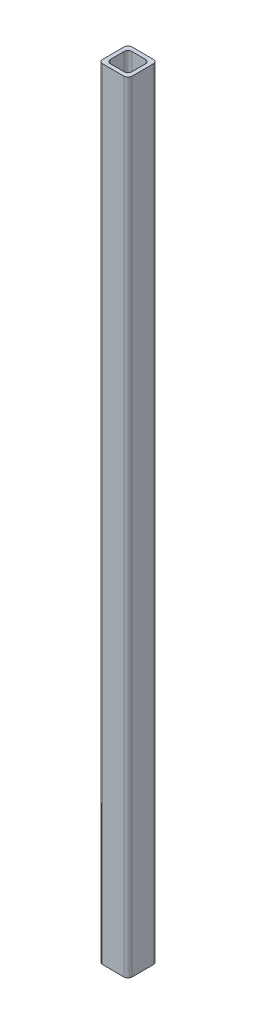
ISO-10303-21;
HEADER;
FILE_DESCRIPTION(('STEP AP214'),'2;1');
FILE_NAME('part.step','',(''),(''),'','','');
FILE_SCHEMA(('AUTOMOTIVE_DESIGN { 1 0 10303 214 1 1 1 1 }'));
ENDSEC;
DATA;
#1=APPLICATION_CONTEXT('core data for automotive mechanical design processes');
#2=APPLICATION_PROTOCOL_DEFINITION('international standard','automotive_design',2000,#1);
#3=PRODUCT_CONTEXT('',#1,'mechanical');
#4=PRODUCT('Part','Part','',(#3));
#5=PRODUCT_RELATED_PRODUCT_CATEGORY('part','',(#4));
#6=PRODUCT_DEFINITION_FORMATION('','',#4);
#7=PRODUCT_DEFINITION_CONTEXT('part definition',#1,'design');
#8=PRODUCT_DEFINITION('design','',#6,#7);
#9=PRODUCT_DEFINITION_SHAPE('','',#8);
#10=(LENGTH_UNIT() NAMED_UNIT(*) SI_UNIT(.MILLI.,.METRE.));
#11=(NAMED_UNIT(*) PLANE_ANGLE_UNIT() SI_UNIT($,.RADIAN.));
#12=(NAMED_UNIT(*) SI_UNIT($,.STERADIAN.) SOLID_ANGLE_UNIT());
#13=UNCERTAINTY_MEASURE_WITH_UNIT(LENGTH_MEASURE(1.E-05),#10,'distance_accuracy_value','');
#14=(GEOMETRIC_REPRESENTATION_CONTEXT(3) GLOBAL_UNCERTAINTY_ASSIGNED_CONTEXT((#13)) GLOBAL_UNIT_ASSIGNED_CONTEXT((#10,
#11,#12)) REPRESENTATION_CONTEXT('',''));
#15=CARTESIAN_POINT('',(0.,0.,0.));
#16=DIRECTION('',(0.,0.,1.));
#17=DIRECTION('',(1.,0.,0.));
#18=AXIS2_PLACEMENT_3D('',#15,#16,#17);
#19=CARTESIAN_POINT('',(11.,800.,-11.));
#20=DIRECTION('',(0.,-1.,0.));
#21=DIRECTION('',(0.,0.,-1.));
#22=AXIS2_PLACEMENT_3D('',#19,#20,#21);
#23=PLANE('',#22);
#24=CARTESIAN_POINT('',(11.,800.,-11.));
#25=DIRECTION('',(0.,1.,0.));
#26=DIRECTION('',(0.,0.,-1.));
#27=AXIS2_PLACEMENT_3D('',#24,#25,#26);
#28=CIRCLE('',#27,4.);
#29=CARTESIAN_POINT('',(15.,800.,-11.));
#30=VERTEX_POINT('',#29);
#31=CARTESIAN_POINT('',(11.,800.,-15.));
#32=VERTEX_POINT('',#31);
#33=EDGE_CURVE('E244',#30,#32,#28,.T.);
#34=ORIENTED_EDGE('',*,*,#33,.T.);
#35=DIRECTION('',(-1.,0.,0.));
#36=VECTOR('',#35,1.);
#37=CARTESIAN_POINT('',(11.,800.,-15.));
#38=LINE('',#37,#36);
#39=CARTESIAN_POINT('',(-11.,800.,-15.));
#40=VERTEX_POINT('',#39);
#41=EDGE_CURVE('E248',#32,#40,#38,.T.);
#42=ORIENTED_EDGE('',*,*,#41,.T.);
#43=CARTESIAN_POINT('',(-11.,800.,-11.));
#44=DIRECTION('',(0.,1.,0.));
#45=DIRECTION('',(0.,0.,-1.));
#46=AXIS2_PLACEMENT_3D('',#43,#44,#45);
#47=CIRCLE('',#46,4.);
#48=CARTESIAN_POINT('',(-15.,800.,-11.));
#49=VERTEX_POINT('',#48);
#50=EDGE_CURVE('E252',#40,#49,#47,.T.);
#51=ORIENTED_EDGE('',*,*,#50,.T.);
#52=DIRECTION('',(0.,0.,1.));
#53=VECTOR('',#52,1.);
#54=CARTESIAN_POINT('',(-15.,800.,-11.));
#55=LINE('',#54,#53);
#56=CARTESIAN_POINT('',(-15.,800.,11.));
#57=VERTEX_POINT('',#56);
#58=EDGE_CURVE('E255',#49,#57,#55,.T.);
#59=ORIENTED_EDGE('',*,*,#58,.T.);
#60=CARTESIAN_POINT('',(-11.,800.,11.));
#61=DIRECTION('',(0.,1.,0.));
#62=DIRECTION('',(0.,0.,1.));
#63=AXIS2_PLACEMENT_3D('',#60,#61,#62);
#64=CIRCLE('',#63,4.);
#65=CARTESIAN_POINT('',(-11.,800.,15.));
#66=VERTEX_POINT('',#65);
#67=EDGE_CURVE('E258',#57,#66,#64,.T.);
#68=ORIENTED_EDGE('',*,*,#67,.T.);
#69=DIRECTION('',(1.,0.,0.));
#70=VECTOR('',#69,1.);
#71=CARTESIAN_POINT('',(11.,800.,15.));
#72=LINE('',#71,#70);
#73=CARTESIAN_POINT('',(11.,800.,15.));
#74=VERTEX_POINT('',#73);
#75=EDGE_CURVE('E261',#66,#74,#72,.T.);
#76=ORIENTED_EDGE('',*,*,#75,.T.);
#77=CARTESIAN_POINT('',(11.,800.,11.));
#78=DIRECTION('',(0.,1.,0.));
#79=DIRECTION('',(0.,0.,-1.));
#80=AXIS2_PLACEMENT_3D('',#77,#78,#79);
#81=CIRCLE('',#80,4.);
#82=CARTESIAN_POINT('',(15.,800.,11.));
#83=VERTEX_POINT('',#82);
#84=EDGE_CURVE('E264',#74,#83,#81,.T.);
#85=ORIENTED_EDGE('',*,*,#84,.T.);
#86=DIRECTION('',(0.,0.,-1.));
#87=VECTOR('',#86,1.);
#88=CARTESIAN_POINT('',(15.,800.,-11.));
#89=LINE('',#88,#87);
#90=EDGE_CURVE('E267',#83,#30,#89,.T.);
#91=ORIENTED_EDGE('',*,*,#90,.T.);
#92=EDGE_LOOP('',(#34,#42,#51,#59,#68,#76,#85,#91));
#93=FACE_BOUND('',#92,.T.);
#94=CARTESIAN_POINT('',(7.,800.,-7.));
#95=DIRECTION('',(0.,1.,0.));
#96=DIRECTION('',(0.,0.,-1.));
#97=AXIS2_PLACEMENT_3D('',#94,#95,#96);
#98=CIRCLE('',#97,4.);
#99=CARTESIAN_POINT('',(11.,800.,-6.99999999999997));
#100=VERTEX_POINT('',#99);
#101=CARTESIAN_POINT('',(6.99999999999997,800.,-11.));
#102=VERTEX_POINT('',#101);
#103=EDGE_CURVE('E155',#100,#102,#98,.T.);
#104=ORIENTED_EDGE('',*,*,#103,.F.);
#105=DIRECTION('',(0.,0.,-1.));
#106=VECTOR('',#105,1.);
#107=CARTESIAN_POINT('',(11.,800.,-6.99999999999997));
#108=LINE('',#107,#106);
#109=CARTESIAN_POINT('',(11.,800.,6.99999999999997));
#110=VERTEX_POINT('',#109);
#111=EDGE_CURVE('E196',#110,#100,#108,.T.);
#112=ORIENTED_EDGE('',*,*,#111,.F.);
#113=CARTESIAN_POINT('',(7.,800.,7.));
#114=DIRECTION('',(0.,1.,0.));
#115=DIRECTION('',(0.,0.,-1.));
#116=AXIS2_PLACEMENT_3D('',#113,#114,#115);
#117=CIRCLE('',#116,4.);
#118=CARTESIAN_POINT('',(6.99999999999997,800.,11.));
#119=VERTEX_POINT('',#118);
#120=EDGE_CURVE('E193',#119,#110,#117,.T.);
#121=ORIENTED_EDGE('',*,*,#120,.F.);
#122=DIRECTION('',(1.,0.,0.));
#123=VECTOR('',#122,1.);
#124=CARTESIAN_POINT('',(6.99999999999997,800.,11.));
#125=LINE('',#124,#123);
#126=CARTESIAN_POINT('',(-6.99999999999997,800.,11.));
#127=VERTEX_POINT('',#126);
#128=EDGE_CURVE('E190',#127,#119,#125,.T.);
#129=ORIENTED_EDGE('',*,*,#128,.F.);
#130=CARTESIAN_POINT('',(-7.,800.,7.));
#131=DIRECTION('',(0.,1.,0.));
#132=DIRECTION('',(0.,0.,-1.));
#133=AXIS2_PLACEMENT_3D('',#130,#131,#132);
#134=CIRCLE('',#133,4.);
#135=CARTESIAN_POINT('',(-11.,800.,6.99999999999997));
#136=VERTEX_POINT('',#135);
#137=EDGE_CURVE('E187',#136,#127,#134,.T.);
#138=ORIENTED_EDGE('',*,*,#137,.F.);
#139=DIRECTION('',(0.,0.,1.));
#140=VECTOR('',#139,1.);
#141=CARTESIAN_POINT('',(-11.,800.,-6.99999999999997));
#142=LINE('',#141,#140);
#143=CARTESIAN_POINT('',(-11.,800.,-6.99999999999997));
#144=VERTEX_POINT('',#143);
#145=EDGE_CURVE('E182',#144,#136,#142,.T.);
#146=ORIENTED_EDGE('',*,*,#145,.F.);
#147=CARTESIAN_POINT('',(-7.,800.,-7.));
#148=DIRECTION('',(0.,1.,0.));
#149=DIRECTION('',(0.,0.,1.));
#150=AXIS2_PLACEMENT_3D('',#147,#148,#149);
#151=CIRCLE('',#150,4.);
#152=CARTESIAN_POINT('',(-6.99999999999997,800.,-11.));
#153=VERTEX_POINT('',#152);
#154=EDGE_CURVE('E178',#153,#144,#151,.T.);
#155=ORIENTED_EDGE('',*,*,#154,.F.);
#156=DIRECTION('',(-1.,0.,0.));
#157=VECTOR('',#156,1.);
#158=CARTESIAN_POINT('',(6.99999999999997,800.,-11.));
#159=LINE('',#158,#157);
#160=EDGE_CURVE('E164',#102,#153,#159,.T.);
#161=ORIENTED_EDGE('',*,*,#160,.F.);
#162=EDGE_LOOP('',(#104,#112,#121,#129,#138,#146,#155,#161));
#163=FACE_BOUND('',#162,.T.);
#164=ADVANCED_FACE('F41',(#93,#163),#23,.F.);
#165=CARTESIAN_POINT('',(11.,0.,-11.));
#166=DIRECTION('',(0.,-1.,0.));
#167=DIRECTION('',(0.,0.,-1.));
#168=AXIS2_PLACEMENT_3D('',#165,#166,#167);
#169=PLANE('',#168);
#170=CARTESIAN_POINT('',(11.,0.,-11.));
#171=DIRECTION('',(0.,1.,0.));
#172=DIRECTION('',(0.,0.,-1.));
#173=AXIS2_PLACEMENT_3D('',#170,#171,#172);
#174=CIRCLE('',#173,4.);
#175=CARTESIAN_POINT('',(15.,0.,-11.));
#176=VERTEX_POINT('',#175);
#177=CARTESIAN_POINT('',(11.,0.,-15.));
#178=VERTEX_POINT('',#177);
#179=EDGE_CURVE('E173',#176,#178,#174,.T.);
#180=ORIENTED_EDGE('',*,*,#179,.F.);
#181=DIRECTION('',(0.,0.,-1.));
#182=VECTOR('',#181,1.);
#183=CARTESIAN_POINT('',(15.,0.,-11.));
#184=LINE('',#183,#182);
#185=CARTESIAN_POINT('',(15.,0.,11.));
#186=VERTEX_POINT('',#185);
#187=EDGE_CURVE('E249',#186,#176,#184,.T.);
#188=ORIENTED_EDGE('',*,*,#187,.F.);
#189=CARTESIAN_POINT('',(11.,0.,11.));
#190=DIRECTION('',(0.,1.,0.));
#191=DIRECTION('',(0.,0.,-1.));
#192=AXIS2_PLACEMENT_3D('',#189,#190,#191);
#193=CIRCLE('',#192,4.);
#194=CARTESIAN_POINT('',(11.,0.,15.));
#195=VERTEX_POINT('',#194);
#196=EDGE_CURVE('E289',#195,#186,#193,.T.);
#197=ORIENTED_EDGE('',*,*,#196,.F.);
#198=DIRECTION('',(1.,0.,0.));
#199=VECTOR('',#198,1.);
#200=CARTESIAN_POINT('',(11.,0.,15.));
#201=LINE('',#200,#199);
#202=CARTESIAN_POINT('',(-11.,0.,15.));
#203=VERTEX_POINT('',#202);
#204=EDGE_CURVE('E286',#203,#195,#201,.T.);
#205=ORIENTED_EDGE('',*,*,#204,.F.);
#206=CARTESIAN_POINT('',(-11.,0.,11.));
#207=DIRECTION('',(0.,1.,0.));
#208=DIRECTION('',(0.,0.,1.));
#209=AXIS2_PLACEMENT_3D('',#206,#207,#208);
#210=CIRCLE('',#209,4.);
#211=CARTESIAN_POINT('',(-15.,0.,11.));
#212=VERTEX_POINT('',#211);
#213=EDGE_CURVE('E283',#212,#203,#210,.T.);
#214=ORIENTED_EDGE('',*,*,#213,.F.);
#215=DIRECTION('',(0.,0.,1.));
#216=VECTOR('',#215,1.);
#217=CARTESIAN_POINT('',(-15.,0.,-11.));
#218=LINE('',#217,#216);
#219=CARTESIAN_POINT('',(-15.,0.,-11.));
#220=VERTEX_POINT('',#219);
#221=EDGE_CURVE('E280',#220,#212,#218,.T.);
#222=ORIENTED_EDGE('',*,*,#221,.F.);
#223=CARTESIAN_POINT('',(-11.,0.,-11.));
#224=DIRECTION('',(0.,1.,0.));
#225=DIRECTION('',(0.,0.,-1.));
#226=AXIS2_PLACEMENT_3D('',#223,#224,#225);
#227=CIRCLE('',#226,4.);
#228=CARTESIAN_POINT('',(-11.,0.,-15.));
#229=VERTEX_POINT('',#228);
#230=EDGE_CURVE('E277',#229,#220,#227,.T.);
#231=ORIENTED_EDGE('',*,*,#230,.F.);
#232=DIRECTION('',(-1.,0.,0.));
#233=VECTOR('',#232,1.);
#234=CARTESIAN_POINT('',(11.,0.,-15.));
#235=LINE('',#234,#233);
#236=EDGE_CURVE('E274',#178,#229,#235,.T.);
#237=ORIENTED_EDGE('',*,*,#236,.F.);
#238=EDGE_LOOP('',(#180,#188,#197,#205,#214,#222,#231,#237));
#239=FACE_BOUND('',#238,.T.);
#240=DIRECTION('',(0.,0.,-1.));
#241=VECTOR('',#240,1.);
#242=CARTESIAN_POINT('',(11.,0.,-6.99999999999997));
#243=LINE('',#242,#241);
#244=CARTESIAN_POINT('',(11.,0.,6.99999999999997));
#245=VERTEX_POINT('',#244);
#246=CARTESIAN_POINT('',(11.,0.,-6.99999999999997));
#247=VERTEX_POINT('',#246);
#248=EDGE_CURVE('E165',#245,#247,#243,.T.);
#249=ORIENTED_EDGE('',*,*,#248,.T.);
#250=CARTESIAN_POINT('',(7.,0.,-7.));
#251=DIRECTION('',(0.,1.,0.));
#252=DIRECTION('',(0.,0.,-1.));
#253=AXIS2_PLACEMENT_3D('',#250,#251,#252);
#254=CIRCLE('',#253,4.);
#255=CARTESIAN_POINT('',(6.99999999999997,0.,-11.));
#256=VERTEX_POINT('',#255);
#257=EDGE_CURVE('E65',#247,#256,#254,.T.);
#258=ORIENTED_EDGE('',*,*,#257,.T.);
#259=DIRECTION('',(-1.,0.,0.));
#260=VECTOR('',#259,1.);
#261=CARTESIAN_POINT('',(6.99999999999997,0.,-11.));
#262=LINE('',#261,#260);
#263=CARTESIAN_POINT('',(-6.99999999999997,0.,-11.));
#264=VERTEX_POINT('',#263);
#265=EDGE_CURVE('E171',#256,#264,#262,.T.);
#266=ORIENTED_EDGE('',*,*,#265,.T.);
#267=CARTESIAN_POINT('',(-7.,0.,-7.));
#268=DIRECTION('',(0.,1.,0.));
#269=DIRECTION('',(0.,0.,1.));
#270=AXIS2_PLACEMENT_3D('',#267,#268,#269);
#271=CIRCLE('',#270,4.);
#272=CARTESIAN_POINT('',(-11.,0.,-6.99999999999997));
#273=VERTEX_POINT('',#272);
#274=EDGE_CURVE('E203',#264,#273,#271,.T.);
#275=ORIENTED_EDGE('',*,*,#274,.T.);
#276=DIRECTION('',(0.,0.,1.));
#277=VECTOR('',#276,1.);
#278=CARTESIAN_POINT('',(-11.,0.,-6.99999999999997));
#279=LINE('',#278,#277);
#280=CARTESIAN_POINT('',(-11.,0.,6.99999999999997));
#281=VERTEX_POINT('',#280);
#282=EDGE_CURVE('E207',#273,#281,#279,.T.);
#283=ORIENTED_EDGE('',*,*,#282,.T.);
#284=CARTESIAN_POINT('',(-7.,0.,7.));
#285=DIRECTION('',(0.,1.,0.));
#286=DIRECTION('',(0.,0.,-1.));
#287=AXIS2_PLACEMENT_3D('',#284,#285,#286);
#288=CIRCLE('',#287,4.);
#289=CARTESIAN_POINT('',(-6.99999999999997,0.,11.));
#290=VERTEX_POINT('',#289);
#291=EDGE_CURVE('E211',#281,#290,#288,.T.);
#292=ORIENTED_EDGE('',*,*,#291,.T.);
#293=DIRECTION('',(1.,0.,0.));
#294=VECTOR('',#293,1.);
#295=CARTESIAN_POINT('',(6.99999999999997,0.,11.));
#296=LINE('',#295,#294);
#297=CARTESIAN_POINT('',(6.99999999999997,0.,11.));
#298=VERTEX_POINT('',#297);
#299=EDGE_CURVE('E215',#290,#298,#296,.T.);
#300=ORIENTED_EDGE('',*,*,#299,.T.);
#301=CARTESIAN_POINT('',(7.,0.,7.));
#302=DIRECTION('',(0.,1.,0.));
#303=DIRECTION('',(0.,0.,-1.));
#304=AXIS2_PLACEMENT_3D('',#301,#302,#303);
#305=CIRCLE('',#304,4.);
#306=EDGE_CURVE('E219',#298,#245,#305,.T.);
#307=ORIENTED_EDGE('',*,*,#306,.T.);
#308=EDGE_LOOP('',(#249,#258,#266,#275,#283,#292,#300,#307));
#309=FACE_BOUND('',#308,.T.);
#310=ADVANCED_FACE('F328',(#239,#309),#169,.T.);
#311=CARTESIAN_POINT('',(11.,800.,-11.));
#312=DIRECTION('',(0.,-1.,0.));
#313=DIRECTION('',(0.,0.,-1.));
#314=AXIS2_PLACEMENT_3D('',#311,#312,#313);
#315=CYLINDRICAL_SURFACE('',#314,4.);
#316=ORIENTED_EDGE('',*,*,#179,.T.);
#317=DIRECTION('',(0.,-1.,0.));
#318=VECTOR('',#317,1.);
#319=CARTESIAN_POINT('',(11.,800.,-15.));
#320=LINE('',#319,#318);
#321=EDGE_CURVE('E11',#32,#178,#320,.T.);
#322=ORIENTED_EDGE('',*,*,#321,.F.);
#323=ORIENTED_EDGE('',*,*,#33,.F.);
#324=DIRECTION('',(0.,-1.,0.));
#325=VECTOR('',#324,1.);
#326=CARTESIAN_POINT('',(15.,800.,-11.));
#327=LINE('',#326,#325);
#328=EDGE_CURVE('E270',#30,#176,#327,.T.);
#329=ORIENTED_EDGE('',*,*,#328,.T.);
#330=EDGE_LOOP('',(#316,#322,#323,#329));
#331=FACE_BOUND('',#330,.T.);
#332=ADVANCED_FACE('F43',(#331),#315,.T.);
#333=CARTESIAN_POINT('',(11.,800.,-15.));
#334=DIRECTION('',(0.,0.,1.));
#335=DIRECTION('',(1.,0.,0.));
#336=AXIS2_PLACEMENT_3D('',#333,#334,#335);
#337=PLANE('',#336);
#338=ORIENTED_EDGE('',*,*,#236,.T.);
#339=DIRECTION('',(0.,-1.,0.));
#340=VECTOR('',#339,1.);
#341=CARTESIAN_POINT('',(-11.,800.,-15.));
#342=LINE('',#341,#340);
#343=EDGE_CURVE('E50',#40,#229,#342,.T.);
#344=ORIENTED_EDGE('',*,*,#343,.F.);
#345=ORIENTED_EDGE('',*,*,#41,.F.);
#346=ORIENTED_EDGE('',*,*,#321,.T.);
#347=EDGE_LOOP('',(#338,#344,#345,#346));
#348=FACE_BOUND('',#347,.T.);
#349=ADVANCED_FACE('F345',(#348),#337,.F.);
#350=CARTESIAN_POINT('',(-11.,800.,-11.));
#351=DIRECTION('',(0.,-1.,0.));
#352=DIRECTION('',(0.,0.,-1.));
#353=AXIS2_PLACEMENT_3D('',#350,#351,#352);
#354=CYLINDRICAL_SURFACE('',#353,4.);
#355=ORIENTED_EDGE('',*,*,#230,.T.);
#356=DIRECTION('',(0.,-1.,0.));
#357=VECTOR('',#356,1.);
#358=CARTESIAN_POINT('',(-15.,800.,-11.));
#359=LINE('',#358,#357);
#360=EDGE_CURVE('E313',#49,#220,#359,.T.);
#361=ORIENTED_EDGE('',*,*,#360,.F.);
#362=ORIENTED_EDGE('',*,*,#50,.F.);
#363=ORIENTED_EDGE('',*,*,#343,.T.);
#364=EDGE_LOOP('',(#355,#361,#362,#363));
#365=FACE_BOUND('',#364,.T.);
#366=ADVANCED_FACE('F322',(#365),#354,.T.);
#367=CARTESIAN_POINT('',(-15.,800.,-11.));
#368=DIRECTION('',(1.,0.,0.));
#369=DIRECTION('',(0.,0.,-1.));
#370=AXIS2_PLACEMENT_3D('',#367,#368,#369);
#371=PLANE('',#370);
#372=ORIENTED_EDGE('',*,*,#221,.T.);
#373=DIRECTION('',(0.,-1.,0.));
#374=VECTOR('',#373,1.);
#375=CARTESIAN_POINT('',(-15.,800.,11.));
#376=LINE('',#375,#374);
#377=EDGE_CURVE('E309',#57,#212,#376,.T.);
#378=ORIENTED_EDGE('',*,*,#377,.F.);
#379=ORIENTED_EDGE('',*,*,#58,.F.);
#380=ORIENTED_EDGE('',*,*,#360,.T.);
#381=EDGE_LOOP('',(#372,#378,#379,#380));
#382=FACE_BOUND('',#381,.T.);
#383=ADVANCED_FACE('F334',(#382),#371,.F.);
#384=CARTESIAN_POINT('',(-11.,800.,11.));
#385=DIRECTION('',(0.,-1.,0.));
#386=DIRECTION('',(0.,0.,-1.));
#387=AXIS2_PLACEMENT_3D('',#384,#385,#386);
#388=CYLINDRICAL_SURFACE('',#387,4.);
#389=ORIENTED_EDGE('',*,*,#213,.T.);
#390=DIRECTION('',(0.,-1.,0.));
#391=VECTOR('',#390,1.);
#392=CARTESIAN_POINT('',(-11.,800.,15.));
#393=LINE('',#392,#391);
#394=EDGE_CURVE('E305',#66,#203,#393,.T.);
#395=ORIENTED_EDGE('',*,*,#394,.F.);
#396=ORIENTED_EDGE('',*,*,#67,.F.);
#397=ORIENTED_EDGE('',*,*,#377,.T.);
#398=EDGE_LOOP('',(#389,#395,#396,#397));
#399=FACE_BOUND('',#398,.T.);
#400=ADVANCED_FACE('F338',(#399),#388,.T.);
#401=CARTESIAN_POINT('',(11.,800.,15.));
#402=DIRECTION('',(0.,0.,-1.));
#403=DIRECTION('',(-1.,0.,0.));
#404=AXIS2_PLACEMENT_3D('',#401,#402,#403);
#405=PLANE('',#404);
#406=ORIENTED_EDGE('',*,*,#204,.T.);
#407=DIRECTION('',(0.,-1.,0.));
#408=VECTOR('',#407,1.);
#409=CARTESIAN_POINT('',(11.,800.,15.));
#410=LINE('',#409,#408);
#411=EDGE_CURVE('E301',#74,#195,#410,.T.);
#412=ORIENTED_EDGE('',*,*,#411,.F.);
#413=ORIENTED_EDGE('',*,*,#75,.F.);
#414=ORIENTED_EDGE('',*,*,#394,.T.);
#415=EDGE_LOOP('',(#406,#412,#413,#414));
#416=FACE_BOUND('',#415,.T.);
#417=ADVANCED_FACE('F358',(#416),#405,.F.);
#418=CARTESIAN_POINT('',(11.,800.,11.));
#419=DIRECTION('',(0.,-1.,0.));
#420=DIRECTION('',(0.,0.,-1.));
#421=AXIS2_PLACEMENT_3D('',#418,#419,#420);
#422=CYLINDRICAL_SURFACE('',#421,4.);
#423=ORIENTED_EDGE('',*,*,#196,.T.);
#424=DIRECTION('',(0.,-1.,0.));
#425=VECTOR('',#424,1.);
#426=CARTESIAN_POINT('',(15.,800.,11.));
#427=LINE('',#426,#425);
#428=EDGE_CURVE('E297',#83,#186,#427,.T.);
#429=ORIENTED_EDGE('',*,*,#428,.F.);
#430=ORIENTED_EDGE('',*,*,#84,.F.);
#431=ORIENTED_EDGE('',*,*,#411,.T.);
#432=EDGE_LOOP('',(#423,#429,#430,#431));
#433=FACE_BOUND('',#432,.T.);
#434=ADVANCED_FACE('F356',(#433),#422,.T.);
#435=CARTESIAN_POINT('',(15.,800.,-11.));
#436=DIRECTION('',(-1.,0.,0.));
#437=DIRECTION('',(0.,0.,1.));
#438=AXIS2_PLACEMENT_3D('',#435,#436,#437);
#439=PLANE('',#438);
#440=ORIENTED_EDGE('',*,*,#187,.T.);
#441=ORIENTED_EDGE('',*,*,#328,.F.);
#442=ORIENTED_EDGE('',*,*,#90,.F.);
#443=ORIENTED_EDGE('',*,*,#428,.T.);
#444=EDGE_LOOP('',(#440,#441,#442,#443));
#445=FACE_BOUND('',#444,.T.);
#446=ADVANCED_FACE('F351',(#445),#439,.F.);
#447=CARTESIAN_POINT('',(7.,800.,-7.));
#448=DIRECTION('',(0.,-1.,0.));
#449=DIRECTION('',(0.,0.,-1.));
#450=AXIS2_PLACEMENT_3D('',#447,#448,#449);
#451=CYLINDRICAL_SURFACE('',#450,4.);
#452=ORIENTED_EDGE('',*,*,#257,.F.);
#453=DIRECTION('',(0.,-1.,0.));
#454=VECTOR('',#453,1.);
#455=CARTESIAN_POINT('',(11.,800.,-6.99999999999997));
#456=LINE('',#455,#454);
#457=EDGE_CURVE('E159',#100,#247,#456,.T.);
#458=ORIENTED_EDGE('',*,*,#457,.F.);
#459=ORIENTED_EDGE('',*,*,#103,.T.);
#460=DIRECTION('',(0.,-1.,0.));
#461=VECTOR('',#460,1.);
#462=CARTESIAN_POINT('',(6.99999999999997,800.,-11.));
#463=LINE('',#462,#461);
#464=EDGE_CURVE('E158',#102,#256,#463,.T.);
#465=ORIENTED_EDGE('',*,*,#464,.T.);
#466=EDGE_LOOP('',(#452,#458,#459,#465));
#467=FACE_BOUND('',#466,.T.);
#468=ADVANCED_FACE('F157',(#467),#451,.F.);
#469=CARTESIAN_POINT('',(6.99999999999997,800.,-11.));
#470=DIRECTION('',(0.,0.,1.));
#471=DIRECTION('',(1.,0.,0.));
#472=AXIS2_PLACEMENT_3D('',#469,#470,#471);
#473=PLANE('',#472);
#474=ORIENTED_EDGE('',*,*,#265,.F.);
#475=ORIENTED_EDGE('',*,*,#464,.F.);
#476=ORIENTED_EDGE('',*,*,#160,.T.);
#477=DIRECTION('',(0.,-1.,0.));
#478=VECTOR('',#477,1.);
#479=CARTESIAN_POINT('',(-6.99999999999997,800.,-11.));
#480=LINE('',#479,#478);
#481=EDGE_CURVE('E174',#153,#264,#480,.T.);
#482=ORIENTED_EDGE('',*,*,#481,.T.);
#483=EDGE_LOOP('',(#474,#475,#476,#482));
#484=FACE_BOUND('',#483,.T.);
#485=ADVANCED_FACE('F168',(#484),#473,.T.);
#486=CARTESIAN_POINT('',(-7.,800.,-7.));
#487=DIRECTION('',(0.,-1.,0.));
#488=DIRECTION('',(0.,0.,-1.));
#489=AXIS2_PLACEMENT_3D('',#486,#487,#488);
#490=CYLINDRICAL_SURFACE('',#489,4.);
#491=ORIENTED_EDGE('',*,*,#274,.F.);
#492=ORIENTED_EDGE('',*,*,#481,.F.);
#493=ORIENTED_EDGE('',*,*,#154,.T.);
#494=DIRECTION('',(0.,-1.,0.));
#495=VECTOR('',#494,1.);
#496=CARTESIAN_POINT('',(-11.,800.,-6.99999999999997));
#497=LINE('',#496,#495);
#498=EDGE_CURVE('E239',#144,#273,#497,.T.);
#499=ORIENTED_EDGE('',*,*,#498,.T.);
#500=EDGE_LOOP('',(#491,#492,#493,#499));
#501=FACE_BOUND('',#500,.T.);
#502=ADVANCED_FACE('F383',(#501),#490,.F.);
#503=CARTESIAN_POINT('',(-11.,800.,-6.99999999999997));
#504=DIRECTION('',(1.,0.,0.));
#505=DIRECTION('',(0.,0.,-1.));
#506=AXIS2_PLACEMENT_3D('',#503,#504,#505);
#507=PLANE('',#506);
#508=ORIENTED_EDGE('',*,*,#282,.F.);
#509=ORIENTED_EDGE('',*,*,#498,.F.);
#510=ORIENTED_EDGE('',*,*,#145,.T.);
#511=DIRECTION('',(0.,-1.,0.));
#512=VECTOR('',#511,1.);
#513=CARTESIAN_POINT('',(-11.,800.,6.99999999999997));
#514=LINE('',#513,#512);
#515=EDGE_CURVE('E236',#136,#281,#514,.T.);
#516=ORIENTED_EDGE('',*,*,#515,.T.);
#517=EDGE_LOOP('',(#508,#509,#510,#516));
#518=FACE_BOUND('',#517,.T.);
#519=ADVANCED_FACE('F387',(#518),#507,.T.);
#520=CARTESIAN_POINT('',(-7.,800.,7.));
#521=DIRECTION('',(0.,-1.,0.));
#522=DIRECTION('',(0.,0.,-1.));
#523=AXIS2_PLACEMENT_3D('',#520,#521,#522);
#524=CYLINDRICAL_SURFACE('',#523,4.);
#525=ORIENTED_EDGE('',*,*,#291,.F.);
#526=ORIENTED_EDGE('',*,*,#515,.F.);
#527=ORIENTED_EDGE('',*,*,#137,.T.);
#528=DIRECTION('',(0.,-1.,0.));
#529=VECTOR('',#528,1.);
#530=CARTESIAN_POINT('',(-6.99999999999997,800.,11.));
#531=LINE('',#530,#529);
#532=EDGE_CURVE('E233',#127,#290,#531,.T.);
#533=ORIENTED_EDGE('',*,*,#532,.T.);
#534=EDGE_LOOP('',(#525,#526,#527,#533));
#535=FACE_BOUND('',#534,.T.);
#536=ADVANCED_FACE('F393',(#535),#524,.F.);
#537=CARTESIAN_POINT('',(6.99999999999997,800.,11.));
#538=DIRECTION('',(0.,0.,-1.));
#539=DIRECTION('',(-1.,0.,0.));
#540=AXIS2_PLACEMENT_3D('',#537,#538,#539);
#541=PLANE('',#540);
#542=ORIENTED_EDGE('',*,*,#299,.F.);
#543=ORIENTED_EDGE('',*,*,#532,.F.);
#544=ORIENTED_EDGE('',*,*,#128,.T.);
#545=DIRECTION('',(0.,-1.,0.));
#546=VECTOR('',#545,1.);
#547=CARTESIAN_POINT('',(6.99999999999997,800.,11.));
#548=LINE('',#547,#546);
#549=EDGE_CURVE('E230',#119,#298,#548,.T.);
#550=ORIENTED_EDGE('',*,*,#549,.T.);
#551=EDGE_LOOP('',(#542,#543,#544,#550));
#552=FACE_BOUND('',#551,.T.);
#553=ADVANCED_FACE('F397',(#552),#541,.T.);
#554=CARTESIAN_POINT('',(7.,800.,7.));
#555=DIRECTION('',(0.,-1.,0.));
#556=DIRECTION('',(0.,0.,-1.));
#557=AXIS2_PLACEMENT_3D('',#554,#555,#556);
#558=CYLINDRICAL_SURFACE('',#557,4.);
#559=ORIENTED_EDGE('',*,*,#306,.F.);
#560=ORIENTED_EDGE('',*,*,#549,.F.);
#561=ORIENTED_EDGE('',*,*,#120,.T.);
#562=DIRECTION('',(0.,-1.,0.));
#563=VECTOR('',#562,1.);
#564=CARTESIAN_POINT('',(11.,800.,6.99999999999997));
#565=LINE('',#564,#563);
#566=EDGE_CURVE('E57',#110,#245,#565,.T.);
#567=ORIENTED_EDGE('',*,*,#566,.T.);
#568=EDGE_LOOP('',(#559,#560,#561,#567));
#569=FACE_BOUND('',#568,.T.);
#570=ADVANCED_FACE('F401',(#569),#558,.F.);
#571=CARTESIAN_POINT('',(11.,800.,-6.99999999999997));
#572=DIRECTION('',(-1.,0.,0.));
#573=DIRECTION('',(0.,0.,1.));
#574=AXIS2_PLACEMENT_3D('',#571,#572,#573);
#575=PLANE('',#574);
#576=ORIENTED_EDGE('',*,*,#248,.F.);
#577=ORIENTED_EDGE('',*,*,#566,.F.);
#578=ORIENTED_EDGE('',*,*,#111,.T.);
#579=ORIENTED_EDGE('',*,*,#457,.T.);
#580=EDGE_LOOP('',(#576,#577,#578,#579));
#581=FACE_BOUND('',#580,.T.);
#582=ADVANCED_FACE('F405',(#581),#575,.T.);
#583=CLOSED_SHELL('',(#164,#310,#332,#349,#366,#383,#400,#417,#434,#446,#468,#485,#502,#519,
#536,#553,#570,#582));
#584=MANIFOLD_SOLID_BREP('B2',#583);
#585=ADVANCED_BREP_SHAPE_REPRESENTATION('',(#18,#584),#14);
#586=SHAPE_DEFINITION_REPRESENTATION(#9,#585);
ENDSEC;
END-ISO-10303-21;
